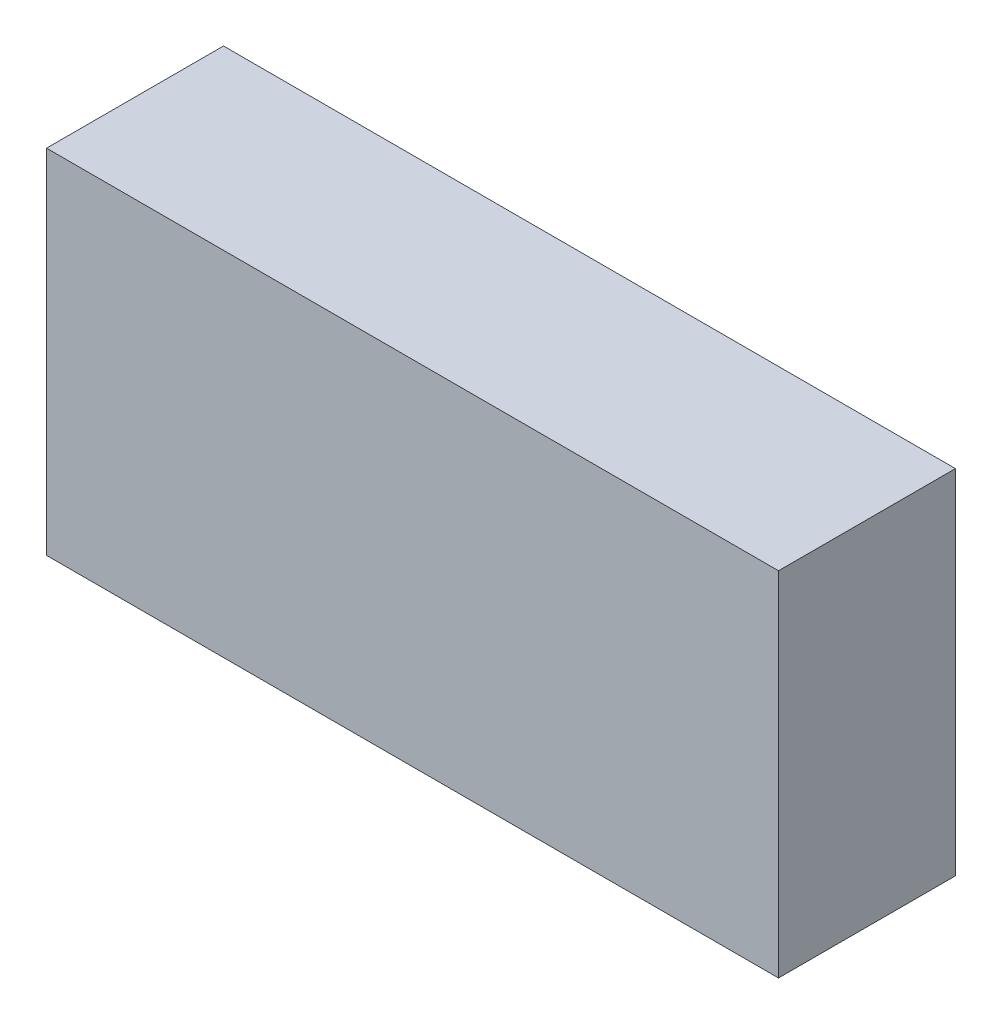
ISO-10303-21;
HEADER;
FILE_DESCRIPTION(('STEP AP214'),'2;1');
FILE_NAME('part.step','',(''),(''),'','','');
FILE_SCHEMA(('AUTOMOTIVE_DESIGN { 1 0 10303 214 1 1 1 1 }'));
ENDSEC;
DATA;
#1=APPLICATION_CONTEXT('core data for automotive mechanical design processes');
#2=APPLICATION_PROTOCOL_DEFINITION('international standard','automotive_design',2000,#1);
#3=PRODUCT_CONTEXT('',#1,'mechanical');
#4=PRODUCT('Part','Part','',(#3));
#5=PRODUCT_RELATED_PRODUCT_CATEGORY('part','',(#4));
#6=PRODUCT_DEFINITION_FORMATION('','',#4);
#7=PRODUCT_DEFINITION_CONTEXT('part definition',#1,'design');
#8=PRODUCT_DEFINITION('design','',#6,#7);
#9=PRODUCT_DEFINITION_SHAPE('','',#8);
#10=(LENGTH_UNIT() NAMED_UNIT(*) SI_UNIT(.MILLI.,.METRE.));
#11=(NAMED_UNIT(*) PLANE_ANGLE_UNIT() SI_UNIT($,.RADIAN.));
#12=(NAMED_UNIT(*) SI_UNIT($,.STERADIAN.) SOLID_ANGLE_UNIT());
#13=UNCERTAINTY_MEASURE_WITH_UNIT(LENGTH_MEASURE(1.E-05),#10,'distance_accuracy_value','');
#14=(GEOMETRIC_REPRESENTATION_CONTEXT(3) GLOBAL_UNCERTAINTY_ASSIGNED_CONTEXT((#13)) GLOBAL_UNIT_ASSIGNED_CONTEXT((#10,
#11,#12)) REPRESENTATION_CONTEXT('',''));
#15=CARTESIAN_POINT('',(0.,0.,0.));
#16=DIRECTION('',(0.,0.,1.));
#17=DIRECTION('',(1.,0.,0.));
#18=AXIS2_PLACEMENT_3D('',#15,#16,#17);
#19=CARTESIAN_POINT('',(0.,0.,48.83));
#20=DIRECTION('',(1.,0.,0.));
#21=DIRECTION('',(0.,0.,-1.));
#22=AXIS2_PLACEMENT_3D('',#19,#20,#21);
#23=PLANE('',#22);
#24=DIRECTION('',(0.,-1.,0.));
#25=VECTOR('',#24,1.);
#26=CARTESIAN_POINT('',(0.,0.,0.));
#27=LINE('',#26,#25);
#28=CARTESIAN_POINT('',(0.,97.33,0.));
#29=VERTEX_POINT('',#28);
#30=CARTESIAN_POINT('',(0.,0.,0.));
#31=VERTEX_POINT('',#30);
#32=EDGE_CURVE('E113',#29,#31,#27,.T.);
#33=ORIENTED_EDGE('',*,*,#32,.T.);
#34=DIRECTION('',(0.,0.,-1.));
#35=VECTOR('',#34,1.);
#36=CARTESIAN_POINT('',(0.,0.,48.83));
#37=LINE('',#36,#35);
#38=CARTESIAN_POINT('',(0.,0.,48.83));
#39=VERTEX_POINT('',#38);
#40=EDGE_CURVE('E11',#39,#31,#37,.T.);
#41=ORIENTED_EDGE('',*,*,#40,.F.);
#42=DIRECTION('',(0.,-1.,0.));
#43=VECTOR('',#42,1.);
#44=CARTESIAN_POINT('',(0.,0.,48.83));
#45=LINE('',#44,#43);
#46=CARTESIAN_POINT('',(0.,97.33,48.83));
#47=VERTEX_POINT('',#46);
#48=EDGE_CURVE('E97',#47,#39,#45,.T.);
#49=ORIENTED_EDGE('',*,*,#48,.F.);
#50=DIRECTION('',(0.,0.,-1.));
#51=VECTOR('',#50,1.);
#52=CARTESIAN_POINT('',(0.,97.33,48.83));
#53=LINE('',#52,#51);
#54=EDGE_CURVE('E109',#47,#29,#53,.T.);
#55=ORIENTED_EDGE('',*,*,#54,.T.);
#56=EDGE_LOOP('',(#33,#41,#49,#55));
#57=FACE_BOUND('',#56,.T.);
#58=ADVANCED_FACE('F45',(#57),#23,.F.);
#59=CARTESIAN_POINT('',(0.,0.,48.83));
#60=DIRECTION('',(0.,1.,0.));
#61=DIRECTION('',(0.,0.,1.));
#62=AXIS2_PLACEMENT_3D('',#59,#60,#61);
#63=PLANE('',#62);
#64=DIRECTION('',(1.,0.,0.));
#65=VECTOR('',#64,1.);
#66=CARTESIAN_POINT('',(0.,0.,0.));
#67=LINE('',#66,#65);
#68=CARTESIAN_POINT('',(202.,0.,0.));
#69=VERTEX_POINT('',#68);
#70=EDGE_CURVE('E102',#31,#69,#67,.T.);
#71=ORIENTED_EDGE('',*,*,#70,.T.);
#72=DIRECTION('',(0.,0.,-1.));
#73=VECTOR('',#72,1.);
#74=CARTESIAN_POINT('',(202.,0.,48.83));
#75=LINE('',#74,#73);
#76=CARTESIAN_POINT('',(202.,0.,48.83));
#77=VERTEX_POINT('',#76);
#78=EDGE_CURVE('E54',#77,#69,#75,.T.);
#79=ORIENTED_EDGE('',*,*,#78,.F.);
#80=DIRECTION('',(1.,0.,0.));
#81=VECTOR('',#80,1.);
#82=CARTESIAN_POINT('',(0.,0.,48.83));
#83=LINE('',#82,#81);
#84=EDGE_CURVE('E92',#39,#77,#83,.T.);
#85=ORIENTED_EDGE('',*,*,#84,.F.);
#86=ORIENTED_EDGE('',*,*,#40,.T.);
#87=EDGE_LOOP('',(#71,#79,#85,#86));
#88=FACE_BOUND('',#87,.T.);
#89=ADVANCED_FACE('F101',(#88),#63,.F.);
#90=CARTESIAN_POINT('',(202.,0.,48.83));
#91=DIRECTION('',(-1.,0.,0.));
#92=DIRECTION('',(0.,0.,1.));
#93=AXIS2_PLACEMENT_3D('',#90,#91,#92);
#94=PLANE('',#93);
#95=DIRECTION('',(0.,1.,0.));
#96=VECTOR('',#95,1.);
#97=CARTESIAN_POINT('',(202.,0.,0.));
#98=LINE('',#97,#96);
#99=CARTESIAN_POINT('',(202.,97.33,0.));
#100=VERTEX_POINT('',#99);
#101=EDGE_CURVE('E79',#69,#100,#98,.T.);
#102=ORIENTED_EDGE('',*,*,#101,.T.);
#103=DIRECTION('',(0.,0.,-1.));
#104=VECTOR('',#103,1.);
#105=CARTESIAN_POINT('',(202.,97.33,48.83));
#106=LINE('',#105,#104);
#107=CARTESIAN_POINT('',(202.,97.33,48.83));
#108=VERTEX_POINT('',#107);
#109=EDGE_CURVE('E104',#108,#100,#106,.T.);
#110=ORIENTED_EDGE('',*,*,#109,.F.);
#111=DIRECTION('',(0.,1.,0.));
#112=VECTOR('',#111,1.);
#113=CARTESIAN_POINT('',(202.,0.,48.83));
#114=LINE('',#113,#112);
#115=EDGE_CURVE('E95',#77,#108,#114,.T.);
#116=ORIENTED_EDGE('',*,*,#115,.F.);
#117=ORIENTED_EDGE('',*,*,#78,.T.);
#118=EDGE_LOOP('',(#102,#110,#116,#117));
#119=FACE_BOUND('',#118,.T.);
#120=ADVANCED_FACE('F105',(#119),#94,.F.);
#121=CARTESIAN_POINT('',(0.,97.33,48.83));
#122=DIRECTION('',(0.,-1.,0.));
#123=DIRECTION('',(0.,0.,-1.));
#124=AXIS2_PLACEMENT_3D('',#121,#122,#123);
#125=PLANE('',#124);
#126=DIRECTION('',(-1.,0.,0.));
#127=VECTOR('',#126,1.);
#128=CARTESIAN_POINT('',(0.,97.33,0.));
#129=LINE('',#128,#127);
#130=EDGE_CURVE('E85',#100,#29,#129,.T.);
#131=ORIENTED_EDGE('',*,*,#130,.T.);
#132=ORIENTED_EDGE('',*,*,#54,.F.);
#133=DIRECTION('',(-1.,0.,0.));
#134=VECTOR('',#133,1.);
#135=CARTESIAN_POINT('',(0.,97.33,48.83));
#136=LINE('',#135,#134);
#137=EDGE_CURVE('E62',#108,#47,#136,.T.);
#138=ORIENTED_EDGE('',*,*,#137,.F.);
#139=ORIENTED_EDGE('',*,*,#109,.T.);
#140=EDGE_LOOP('',(#131,#132,#138,#139));
#141=FACE_BOUND('',#140,.T.);
#142=ADVANCED_FACE('F126',(#141),#125,.F.);
#143=CARTESIAN_POINT('',(0.,0.,48.83));
#144=DIRECTION('',(0.,0.,-1.));
#145=DIRECTION('',(-1.,0.,0.));
#146=AXIS2_PLACEMENT_3D('',#143,#144,#145);
#147=PLANE('',#146);
#148=ORIENTED_EDGE('',*,*,#48,.T.);
#149=ORIENTED_EDGE('',*,*,#84,.T.);
#150=ORIENTED_EDGE('',*,*,#115,.T.);
#151=ORIENTED_EDGE('',*,*,#137,.T.);
#152=EDGE_LOOP('',(#148,#149,#150,#151));
#153=FACE_BOUND('',#152,.T.);
#154=ADVANCED_FACE('F93',(#153),#147,.F.);
#155=CARTESIAN_POINT('',(0.,0.,0.));
#156=DIRECTION('',(0.,0.,-1.));
#157=DIRECTION('',(-1.,0.,0.));
#158=AXIS2_PLACEMENT_3D('',#155,#156,#157);
#159=PLANE('',#158);
#160=ORIENTED_EDGE('',*,*,#32,.F.);
#161=ORIENTED_EDGE('',*,*,#130,.F.);
#162=ORIENTED_EDGE('',*,*,#101,.F.);
#163=ORIENTED_EDGE('',*,*,#70,.F.);
#164=EDGE_LOOP('',(#160,#161,#162,#163));
#165=FACE_BOUND('',#164,.T.);
#166=ADVANCED_FACE('F129',(#165),#159,.T.);
#167=CLOSED_SHELL('',(#58,#89,#120,#142,#154,#166));
#168=MANIFOLD_SOLID_BREP('B2',#167);
#169=ADVANCED_BREP_SHAPE_REPRESENTATION('',(#18,#168),#14);
#170=SHAPE_DEFINITION_REPRESENTATION(#9,#169);
ENDSEC;
END-ISO-10303-21;
